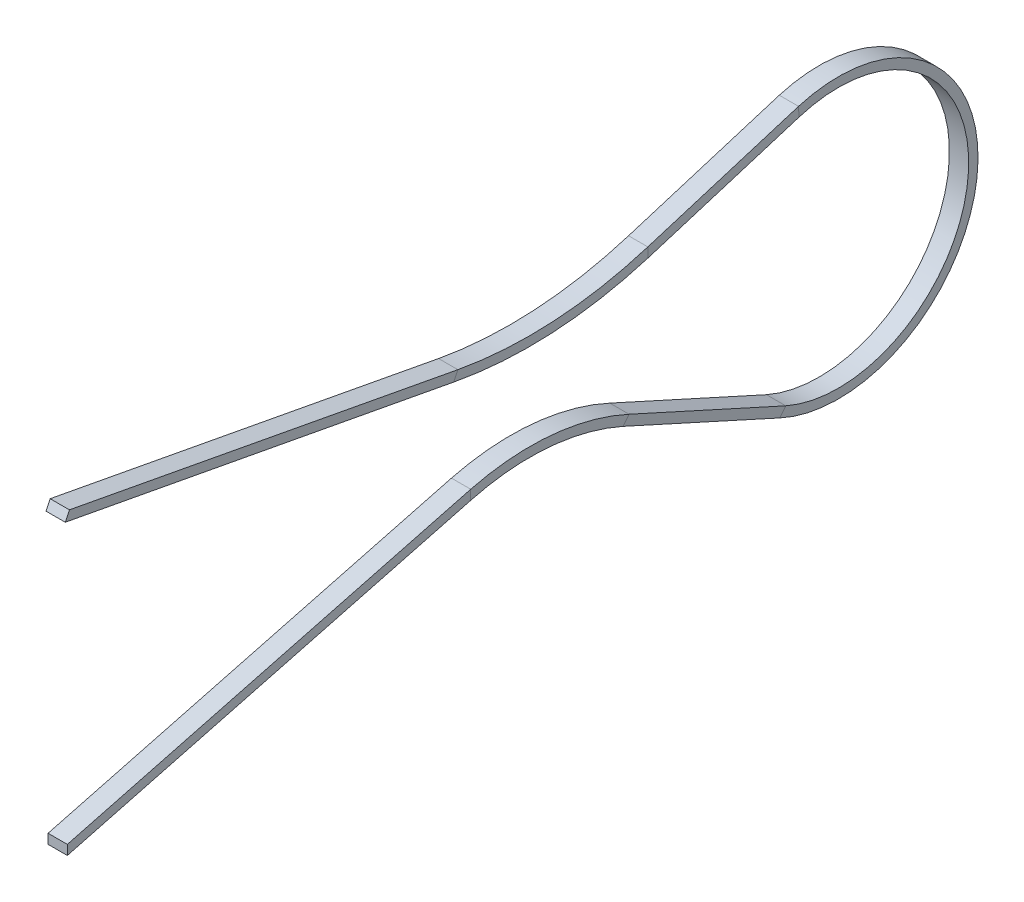
ISO-10303-21;
HEADER;
FILE_DESCRIPTION(('STEP AP214'),'2;1');
FILE_NAME('part.step','',(''),(''),'','','');
FILE_SCHEMA(('AUTOMOTIVE_DESIGN { 1 0 10303 214 1 1 1 1 }'));
ENDSEC;
DATA;
#1=APPLICATION_CONTEXT('core data for automotive mechanical design processes');
#2=APPLICATION_PROTOCOL_DEFINITION('international standard','automotive_design',2000,#1);
#3=PRODUCT_CONTEXT('',#1,'mechanical');
#4=PRODUCT('Part','Part','',(#3));
#5=PRODUCT_RELATED_PRODUCT_CATEGORY('part','',(#4));
#6=PRODUCT_DEFINITION_FORMATION('','',#4);
#7=PRODUCT_DEFINITION_CONTEXT('part definition',#1,'design');
#8=PRODUCT_DEFINITION('design','',#6,#7);
#9=PRODUCT_DEFINITION_SHAPE('','',#8);
#10=(LENGTH_UNIT() NAMED_UNIT(*) SI_UNIT(.MILLI.,.METRE.));
#11=(NAMED_UNIT(*) PLANE_ANGLE_UNIT() SI_UNIT($,.RADIAN.));
#12=(NAMED_UNIT(*) SI_UNIT($,.STERADIAN.) SOLID_ANGLE_UNIT());
#13=UNCERTAINTY_MEASURE_WITH_UNIT(LENGTH_MEASURE(1.E-05),#10,'distance_accuracy_value','');
#14=(GEOMETRIC_REPRESENTATION_CONTEXT(3) GLOBAL_UNCERTAINTY_ASSIGNED_CONTEXT((#13)) GLOBAL_UNIT_ASSIGNED_CONTEXT((#10,
#11,#12)) REPRESENTATION_CONTEXT('',''));
#15=CARTESIAN_POINT('',(0.,0.,0.));
#16=DIRECTION('',(0.,0.,1.));
#17=DIRECTION('',(1.,0.,0.));
#18=AXIS2_PLACEMENT_3D('',#15,#16,#17);
#19=CARTESIAN_POINT('',(0.,0.,0.));
#20=DIRECTION('',(0.,0.,1.));
#21=DIRECTION('',(1.,0.,0.));
#22=AXIS2_PLACEMENT_3D('',#19,#20,#21);
#23=PLANE('',#22);
#24=DIRECTION('',(0.,1.,0.));
#25=VECTOR('',#24,1.);
#26=CARTESIAN_POINT('',(0.5,0.25,0.));
#27=LINE('',#26,#25);
#28=CARTESIAN_POINT('',(0.5,-0.25,0.));
#29=VERTEX_POINT('',#28);
#30=CARTESIAN_POINT('',(0.5,0.25,0.));
#31=VERTEX_POINT('',#30);
#32=EDGE_CURVE('E181',#29,#31,#27,.T.);
#33=ORIENTED_EDGE('',*,*,#32,.T.);
#34=DIRECTION('',(-1.,0.,0.));
#35=VECTOR('',#34,1.);
#36=CARTESIAN_POINT('',(-0.5,0.25,0.));
#37=LINE('',#36,#35);
#38=CARTESIAN_POINT('',(-0.5,0.25,0.));
#39=VERTEX_POINT('',#38);
#40=EDGE_CURVE('E180',#31,#39,#37,.T.);
#41=ORIENTED_EDGE('',*,*,#40,.T.);
#42=DIRECTION('',(0.,-1.,0.));
#43=VECTOR('',#42,1.);
#44=CARTESIAN_POINT('',(-0.5,0.25,0.));
#45=LINE('',#44,#43);
#46=CARTESIAN_POINT('',(-0.5,-0.25,0.));
#47=VERTEX_POINT('',#46);
#48=EDGE_CURVE('E167',#39,#47,#45,.T.);
#49=ORIENTED_EDGE('',*,*,#48,.T.);
#50=DIRECTION('',(1.,0.,0.));
#51=VECTOR('',#50,1.);
#52=CARTESIAN_POINT('',(-0.5,-0.25,0.));
#53=LINE('',#52,#51);
#54=EDGE_CURVE('E177',#47,#29,#53,.T.);
#55=ORIENTED_EDGE('',*,*,#54,.T.);
#56=EDGE_LOOP('',(#33,#41,#49,#55));
#57=FACE_BOUND('',#56,.T.);
#58=ADVANCED_FACE('F35',(#57),#23,.T.);
#59=CARTESIAN_POINT('',(0.,15.,0.));
#60=DIRECTION('',(0.,-0.427760387668771,-0.903892167651353));
#61=DIRECTION('',(1.,0.,0.));
#62=AXIS2_PLACEMENT_3D('',#59,#60,#61);
#63=PLANE('',#62);
#64=DIRECTION('',(0.,-0.903892167651353,0.427760387668771));
#65=VECTOR('',#64,1.);
#66=CARTESIAN_POINT('',(0.5,14.7740269580872,0.106940096917189));
#67=LINE('',#66,#65);
#68=CARTESIAN_POINT('',(0.5,15.2259730419128,-0.106940096917198));
#69=VERTEX_POINT('',#68);
#70=CARTESIAN_POINT('',(0.5,14.7740269580872,0.106940096917187));
#71=VERTEX_POINT('',#70);
#72=EDGE_CURVE('E49',#69,#71,#67,.T.);
#73=ORIENTED_EDGE('',*,*,#72,.F.);
#74=DIRECTION('',(1.,0.,0.));
#75=VECTOR('',#74,1.);
#76=CARTESIAN_POINT('',(-0.5,15.2259730419128,-0.106940096917196));
#77=LINE('',#76,#75);
#78=CARTESIAN_POINT('',(-0.5,15.2259730419128,-0.106940096917198));
#79=VERTEX_POINT('',#78);
#80=EDGE_CURVE('E58',#79,#69,#77,.T.);
#81=ORIENTED_EDGE('',*,*,#80,.F.);
#82=DIRECTION('',(0.,0.903892167651353,-0.427760387668771));
#83=VECTOR('',#82,1.);
#84=CARTESIAN_POINT('',(-0.5,14.7740269580872,0.106940096917189));
#85=LINE('',#84,#83);
#86=CARTESIAN_POINT('',(-0.5,14.7740269580872,0.106940096917187));
#87=VERTEX_POINT('',#86);
#88=EDGE_CURVE('E247',#87,#79,#85,.T.);
#89=ORIENTED_EDGE('',*,*,#88,.F.);
#90=DIRECTION('',(-1.,0.,0.));
#91=VECTOR('',#90,1.);
#92=CARTESIAN_POINT('',(-0.5,14.7740269580872,0.106940096917189));
#93=LINE('',#92,#91);
#94=EDGE_CURVE('E11',#71,#87,#93,.T.);
#95=ORIENTED_EDGE('',*,*,#94,.F.);
#96=EDGE_LOOP('',(#73,#81,#89,#95));
#97=FACE_BOUND('',#96,.T.);
#98=ADVANCED_FACE('F390',(#97),#63,.F.);
#99=CARTESIAN_POINT('',(-0.5,0.25,0.));
#100=DIRECTION('',(1.,0.,0.));
#101=DIRECTION('',(0.,1.,0.));
#102=AXIS2_PLACEMENT_3D('',#99,#100,#101);
#103=PLANE('',#102);
#104=DIRECTION('',(0.,0.253856824292073,-0.967241806768268));
#105=VECTOR('',#104,1.);
#106=CARTESIAN_POINT('',(-0.5,-0.25,0.));
#107=LINE('',#106,#105);
#108=CARTESIAN_POINT('',(-0.5,5.24194972708737,-20.9253518849537));
#109=VERTEX_POINT('',#108);
#110=EDGE_CURVE('E174',#47,#109,#107,.T.);
#111=ORIENTED_EDGE('',*,*,#110,.F.);
#112=ORIENTED_EDGE('',*,*,#48,.F.);
#113=DIRECTION('',(0.,0.253856824292073,-0.967241806768268));
#114=VECTOR('',#113,1.);
#115=CARTESIAN_POINT('',(-0.5,0.25,0.));
#116=LINE('',#115,#114);
#117=CARTESIAN_POINT('',(-0.5,5.74194972708737,-20.9253518849537));
#118=VERTEX_POINT('',#117);
#119=EDGE_CURVE('E172',#39,#118,#116,.T.);
#120=ORIENTED_EDGE('',*,*,#119,.T.);
#121=DIRECTION('',(0.,-1.,0.));
#122=VECTOR('',#121,1.);
#123=CARTESIAN_POINT('',(-0.5,5.74194972708737,-20.9253518849537));
#124=LINE('',#123,#122);
#125=EDGE_CURVE('E191',#118,#109,#124,.T.);
#126=ORIENTED_EDGE('',*,*,#125,.T.);
#127=EDGE_LOOP('',(#111,#112,#120,#126));
#128=FACE_BOUND('',#127,.T.);
#129=ADVANCED_FACE('F169',(#128),#103,.F.);
#130=CARTESIAN_POINT('',(-0.5,-0.25,0.));
#131=DIRECTION('',(0.,0.967241806768268,0.253856824292073));
#132=DIRECTION('',(0.,-0.253856824292073,0.967241806768268));
#133=AXIS2_PLACEMENT_3D('',#130,#131,#132);
#134=PLANE('',#133);
#135=DIRECTION('',(0.,0.253856824292073,-0.967241806768268));
#136=VECTOR('',#135,1.);
#137=CARTESIAN_POINT('',(0.5,-0.25,0.));
#138=LINE('',#137,#136);
#139=CARTESIAN_POINT('',(0.5,5.24194972708737,-20.9253518849537));
#140=VERTEX_POINT('',#139);
#141=EDGE_CURVE('E258',#29,#140,#138,.T.);
#142=ORIENTED_EDGE('',*,*,#141,.F.);
#143=ORIENTED_EDGE('',*,*,#54,.F.);
#144=ORIENTED_EDGE('',*,*,#110,.T.);
#145=DIRECTION('',(1.,0.,0.));
#146=VECTOR('',#145,1.);
#147=CARTESIAN_POINT('',(-0.5,5.24194972708737,-20.9253518849537));
#148=LINE('',#147,#146);
#149=EDGE_CURVE('E255',#109,#140,#148,.T.);
#150=ORIENTED_EDGE('',*,*,#149,.T.);
#151=EDGE_LOOP('',(#142,#143,#144,#150));
#152=FACE_BOUND('',#151,.T.);
#153=ADVANCED_FACE('F397',(#152),#134,.F.);
#154=CARTESIAN_POINT('',(0.5,0.25,0.));
#155=DIRECTION('',(-1.,0.,0.));
#156=DIRECTION('',(0.,-1.,0.));
#157=AXIS2_PLACEMENT_3D('',#154,#155,#156);
#158=PLANE('',#157);
#159=DIRECTION('',(0.,0.253856824292073,-0.967241806768268));
#160=VECTOR('',#159,1.);
#161=CARTESIAN_POINT('',(0.5,0.25,0.));
#162=LINE('',#161,#160);
#163=CARTESIAN_POINT('',(0.5,5.74194972708737,-20.9253518849537));
#164=VERTEX_POINT('',#163);
#165=EDGE_CURVE('E294',#31,#164,#162,.T.);
#166=ORIENTED_EDGE('',*,*,#165,.F.);
#167=ORIENTED_EDGE('',*,*,#32,.F.);
#168=ORIENTED_EDGE('',*,*,#141,.T.);
#169=DIRECTION('',(0.,1.,0.));
#170=VECTOR('',#169,1.);
#171=CARTESIAN_POINT('',(0.5,5.74194972708737,-20.9253518849537));
#172=LINE('',#171,#170);
#173=EDGE_CURVE('E261',#140,#164,#172,.T.);
#174=ORIENTED_EDGE('',*,*,#173,.T.);
#175=EDGE_LOOP('',(#166,#167,#168,#174));
#176=FACE_BOUND('',#175,.T.);
#177=ADVANCED_FACE('F372',(#176),#158,.F.);
#178=CARTESIAN_POINT('',(-0.5,0.25,0.));
#179=DIRECTION('',(0.,-0.967241806768268,-0.253856824292073));
#180=DIRECTION('',(0.,0.253856824292073,-0.967241806768268));
#181=AXIS2_PLACEMENT_3D('',#178,#179,#180);
#182=PLANE('',#181);
#183=DIRECTION('',(-1.,0.,0.));
#184=VECTOR('',#183,1.);
#185=CARTESIAN_POINT('',(-0.5,5.74194972708737,-20.9253518849537));
#186=LINE('',#185,#184);
#187=EDGE_CURVE('E189',#164,#118,#186,.T.);
#188=ORIENTED_EDGE('',*,*,#187,.T.);
#189=ORIENTED_EDGE('',*,*,#119,.F.);
#190=ORIENTED_EDGE('',*,*,#40,.F.);
#191=ORIENTED_EDGE('',*,*,#165,.T.);
#192=EDGE_LOOP('',(#188,#189,#190,#191));
#193=FACE_BOUND('',#192,.T.);
#194=ADVANCED_FACE('F187',(#193),#182,.F.);
#195=CARTESIAN_POINT('',(-0.5,5.74194972708737,-20.9253518849537));
#196=DIRECTION('',(1.,0.,0.));
#197=DIRECTION('',(0.,0.,-1.));
#198=AXIS2_PLACEMENT_3D('',#195,#196,#197);
#199=PLANE('',#198);
#200=CARTESIAN_POINT('',(-0.5,-6.19830900660814,-23.9935111978809));
#201=DIRECTION('',(-1.,0.,0.));
#202=DIRECTION('',(0.,0.965867732518851,0.25903575675743));
#203=AXIS2_PLACEMENT_3D('',#200,#201,#202);
#204=CIRCLE('',#203,11.8445397320199);
#205=CARTESIAN_POINT('',(-0.5,4.61492297526486,-28.8274677108832));
#206=VERTEX_POINT('',#205);
#207=EDGE_CURVE('E199',#109,#206,#204,.T.);
#208=ORIENTED_EDGE('',*,*,#207,.F.);
#209=ORIENTED_EDGE('',*,*,#125,.F.);
#210=CARTESIAN_POINT('',(-0.5,-6.19830900660814,-23.9935111978809));
#211=DIRECTION('',(-1.,0.,0.));
#212=DIRECTION('',(0.,0.968535821916987,0.248874188423763));
#213=AXIS2_PLACEMENT_3D('',#210,#211,#212);
#214=CIRCLE('',#213,12.3281539655008);
#215=CARTESIAN_POINT('',(-0.5,5.00294920844996,-29.1428018865765));
#216=VERTEX_POINT('',#215);
#217=EDGE_CURVE('E200',#118,#216,#214,.T.);
#218=ORIENTED_EDGE('',*,*,#217,.T.);
#219=DIRECTION('',(0.,-0.776052466370204,0.630668351386625));
#220=VECTOR('',#219,1.);
#221=CARTESIAN_POINT('',(-0.5,5.00294920844996,-29.1428018865765));
#222=LINE('',#221,#220);
#223=EDGE_CURVE('E196',#216,#206,#222,.T.);
#224=ORIENTED_EDGE('',*,*,#223,.T.);
#225=EDGE_LOOP('',(#208,#209,#218,#224));
#226=FACE_BOUND('',#225,.T.);
#227=ADVANCED_FACE('F371',(#226),#199,.F.);
#228=CARTESIAN_POINT('',(0.,-6.19830900660814,-23.9935111978809));
#229=DIRECTION('',(-1.,0.,0.));
#230=DIRECTION('',(0.,0.,1.));
#231=AXIS2_PLACEMENT_3D('',#228,#229,#230);
#232=CYLINDRICAL_SURFACE('',#231,11.8445397320199);
#233=CARTESIAN_POINT('',(0.5,-6.19830900660814,-23.9935111978809));
#234=DIRECTION('',(-1.,0.,0.));
#235=DIRECTION('',(0.,0.965867732518851,0.25903575675743));
#236=AXIS2_PLACEMENT_3D('',#233,#234,#235);
#237=CIRCLE('',#236,11.8445397320199);
#238=CARTESIAN_POINT('',(0.5,4.61492297526486,-28.8274677108832));
#239=VERTEX_POINT('',#238);
#240=EDGE_CURVE('E264',#140,#239,#237,.T.);
#241=ORIENTED_EDGE('',*,*,#240,.F.);
#242=ORIENTED_EDGE('',*,*,#149,.F.);
#243=ORIENTED_EDGE('',*,*,#207,.T.);
#244=DIRECTION('',(1.,0.,0.));
#245=VECTOR('',#244,1.);
#246=CARTESIAN_POINT('',(-0.5,4.61492297526486,-28.8274677108832));
#247=LINE('',#246,#245);
#248=EDGE_CURVE('E203',#206,#239,#247,.T.);
#249=ORIENTED_EDGE('',*,*,#248,.T.);
#250=EDGE_LOOP('',(#241,#242,#243,#249));
#251=FACE_BOUND('',#250,.T.);
#252=ADVANCED_FACE('F421',(#251),#232,.F.);
#253=CARTESIAN_POINT('',(0.5,5.74194972708737,-20.9253518849537));
#254=DIRECTION('',(-1.,0.,0.));
#255=DIRECTION('',(0.,0.,1.));
#256=AXIS2_PLACEMENT_3D('',#253,#254,#255);
#257=PLANE('',#256);
#258=CARTESIAN_POINT('',(0.5,-6.19830900660814,-23.9935111978809));
#259=DIRECTION('',(-1.,0.,0.));
#260=DIRECTION('',(0.,0.968535821916987,0.248874188423763));
#261=AXIS2_PLACEMENT_3D('',#258,#259,#260);
#262=CIRCLE('',#261,12.3281539655008);
#263=CARTESIAN_POINT('',(0.5,5.00294920844996,-29.1428018865765));
#264=VERTEX_POINT('',#263);
#265=EDGE_CURVE('E298',#164,#264,#262,.T.);
#266=ORIENTED_EDGE('',*,*,#265,.F.);
#267=ORIENTED_EDGE('',*,*,#173,.F.);
#268=ORIENTED_EDGE('',*,*,#240,.T.);
#269=DIRECTION('',(0.,0.776052466370204,-0.630668351386625));
#270=VECTOR('',#269,1.);
#271=CARTESIAN_POINT('',(0.5,5.00294920844996,-29.1428018865765));
#272=LINE('',#271,#270);
#273=EDGE_CURVE('E267',#239,#264,#272,.T.);
#274=ORIENTED_EDGE('',*,*,#273,.T.);
#275=EDGE_LOOP('',(#266,#267,#268,#274));
#276=FACE_BOUND('',#275,.T.);
#277=ADVANCED_FACE('F377',(#276),#257,.F.);
#278=CARTESIAN_POINT('',(0.,-6.19830900660814,-23.9935111978809));
#279=DIRECTION('',(-1.,0.,0.));
#280=DIRECTION('',(0.,0.,1.));
#281=AXIS2_PLACEMENT_3D('',#278,#279,#280);
#282=CYLINDRICAL_SURFACE('',#281,12.3281539655008);
#283=DIRECTION('',(-1.,0.,0.));
#284=VECTOR('',#283,1.);
#285=CARTESIAN_POINT('',(-0.5,5.00294920844996,-29.1428018865765));
#286=LINE('',#285,#284);
#287=EDGE_CURVE('E216',#264,#216,#286,.T.);
#288=ORIENTED_EDGE('',*,*,#287,.T.);
#289=ORIENTED_EDGE('',*,*,#217,.F.);
#290=ORIENTED_EDGE('',*,*,#187,.F.);
#291=ORIENTED_EDGE('',*,*,#265,.T.);
#292=EDGE_LOOP('',(#288,#289,#290,#291));
#293=FACE_BOUND('',#292,.T.);
#294=ADVANCED_FACE('F373',(#293),#282,.T.);
#295=CARTESIAN_POINT('',(-0.5,5.00294920844996,-29.1428018865765));
#296=DIRECTION('',(1.,0.,0.));
#297=DIRECTION('',(0.,1.,0.));
#298=AXIS2_PLACEMENT_3D('',#295,#296,#297);
#299=PLANE('',#298);
#300=DIRECTION('',(0.,-0.413002581069993,-0.910729854583412));
#301=VECTOR('',#300,1.);
#302=CARTESIAN_POINT('',(-0.5,4.61492297526485,-28.8274677108832));
#303=LINE('',#302,#301);
#304=CARTESIAN_POINT('',(-0.5,0.930877901323559,-36.9513148446634));
#305=VERTEX_POINT('',#304);
#306=EDGE_CURVE('E209',#206,#305,#303,.T.);
#307=ORIENTED_EDGE('',*,*,#306,.F.);
#308=ORIENTED_EDGE('',*,*,#223,.F.);
#309=DIRECTION('',(0.,-0.413002581069993,-0.910729854583412));
#310=VECTOR('',#309,1.);
#311=CARTESIAN_POINT('',(-0.5,5.00294920844996,-29.1428018865765));
#312=LINE('',#311,#310);
#313=CARTESIAN_POINT('',(-0.5,1.31890413450866,-37.2666490203567));
#314=VERTEX_POINT('',#313);
#315=EDGE_CURVE('E210',#216,#314,#312,.T.);
#316=ORIENTED_EDGE('',*,*,#315,.T.);
#317=DIRECTION('',(0.,-0.776052466370204,0.630668351386625));
#318=VECTOR('',#317,1.);
#319=CARTESIAN_POINT('',(-0.5,1.31890413450866,-37.2666490203567));
#320=LINE('',#319,#318);
#321=EDGE_CURVE('E206',#314,#305,#320,.T.);
#322=ORIENTED_EDGE('',*,*,#321,.T.);
#323=EDGE_LOOP('',(#307,#308,#316,#322));
#324=FACE_BOUND('',#323,.T.);
#325=ADVANCED_FACE('F376',(#324),#299,.F.);
#326=CARTESIAN_POINT('',(-0.5,4.61492297526485,-28.8274677108832));
#327=DIRECTION('',(0.,0.910729854583413,-0.413002581069993));
#328=DIRECTION('',(0.,0.413002581069993,0.910729854583412));
#329=AXIS2_PLACEMENT_3D('',#326,#327,#328);
#330=PLANE('',#329);
#331=DIRECTION('',(0.,-0.413002581069993,-0.910729854583412));
#332=VECTOR('',#331,1.);
#333=CARTESIAN_POINT('',(0.5,4.61492297526485,-28.8274677108832));
#334=LINE('',#333,#332);
#335=CARTESIAN_POINT('',(0.5,0.930877901323559,-36.9513148446634));
#336=VERTEX_POINT('',#335);
#337=EDGE_CURVE('E270',#239,#336,#334,.T.);
#338=ORIENTED_EDGE('',*,*,#337,.F.);
#339=ORIENTED_EDGE('',*,*,#248,.F.);
#340=ORIENTED_EDGE('',*,*,#306,.T.);
#341=DIRECTION('',(1.,0.,0.));
#342=VECTOR('',#341,1.);
#343=CARTESIAN_POINT('',(-0.5,0.930877901323561,-36.9513148446634));
#344=LINE('',#343,#342);
#345=EDGE_CURVE('E213',#305,#336,#344,.T.);
#346=ORIENTED_EDGE('',*,*,#345,.T.);
#347=EDGE_LOOP('',(#338,#339,#340,#346));
#348=FACE_BOUND('',#347,.T.);
#349=ADVANCED_FACE('F418',(#348),#330,.F.);
#350=CARTESIAN_POINT('',(0.5,5.00294920844996,-29.1428018865765));
#351=DIRECTION('',(-1.,0.,0.));
#352=DIRECTION('',(0.,-1.,0.));
#353=AXIS2_PLACEMENT_3D('',#350,#351,#352);
#354=PLANE('',#353);
#355=DIRECTION('',(0.,-0.413002581069993,-0.910729854583412));
#356=VECTOR('',#355,1.);
#357=CARTESIAN_POINT('',(0.5,5.00294920844996,-29.1428018865765));
#358=LINE('',#357,#356);
#359=CARTESIAN_POINT('',(0.5,1.31890413450866,-37.2666490203567));
#360=VERTEX_POINT('',#359);
#361=EDGE_CURVE('E303',#264,#360,#358,.T.);
#362=ORIENTED_EDGE('',*,*,#361,.F.);
#363=ORIENTED_EDGE('',*,*,#273,.F.);
#364=ORIENTED_EDGE('',*,*,#337,.T.);
#365=DIRECTION('',(0.,0.776052466370204,-0.630668351386625));
#366=VECTOR('',#365,1.);
#367=CARTESIAN_POINT('',(0.5,1.31890413450866,-37.2666490203567));
#368=LINE('',#367,#366);
#369=EDGE_CURVE('E273',#336,#360,#368,.T.);
#370=ORIENTED_EDGE('',*,*,#369,.T.);
#371=EDGE_LOOP('',(#362,#363,#364,#370));
#372=FACE_BOUND('',#371,.T.);
#373=ADVANCED_FACE('F383',(#372),#354,.F.);
#374=CARTESIAN_POINT('',(-0.5,5.00294920844996,-29.1428018865765));
#375=DIRECTION('',(0.,-0.910729854583413,0.413002581069993));
#376=DIRECTION('',(0.,-0.413002581069993,-0.910729854583412));
#377=AXIS2_PLACEMENT_3D('',#374,#375,#376);
#378=PLANE('',#377);
#379=DIRECTION('',(-1.,0.,0.));
#380=VECTOR('',#379,1.);
#381=CARTESIAN_POINT('',(-0.5,1.31890413450866,-37.2666490203567));
#382=LINE('',#381,#380);
#383=EDGE_CURVE('E227',#360,#314,#382,.T.);
#384=ORIENTED_EDGE('',*,*,#383,.T.);
#385=ORIENTED_EDGE('',*,*,#315,.F.);
#386=ORIENTED_EDGE('',*,*,#287,.F.);
#387=ORIENTED_EDGE('',*,*,#361,.T.);
#388=EDGE_LOOP('',(#384,#385,#386,#387));
#389=FACE_BOUND('',#388,.T.);
#390=ADVANCED_FACE('F379',(#389),#378,.F.);
#391=CARTESIAN_POINT('',(-0.5,1.31890413450866,-37.2666490203567));
#392=DIRECTION('',(1.,0.,0.));
#393=DIRECTION('',(0.,0.,-1.));
#394=AXIS2_PLACEMENT_3D('',#391,#392,#393);
#395=PLANE('',#394);
#396=CARTESIAN_POINT('',(-0.5,7.5,-40.));
#397=DIRECTION('',(1.,0.,0.));
#398=DIRECTION('',(0.,-0.90707564102538,0.420967672699932));
#399=AXIS2_PLACEMENT_3D('',#396,#397,#398);
#400=CIRCLE('',#399,7.2420885332678);
#401=CARTESIAN_POINT('',(-0.5,14.4404804570597,-37.931769512636));
#402=VERTEX_POINT('',#401);
#403=EDGE_CURVE('E220',#305,#402,#400,.T.);
#404=ORIENTED_EDGE('',*,*,#403,.F.);
#405=ORIENTED_EDGE('',*,*,#321,.F.);
#406=CARTESIAN_POINT('',(-0.5,7.5,-40.));
#407=DIRECTION('',(1.,0.,0.));
#408=DIRECTION('',(0.,-0.914567917628712,0.404432347920244));
#409=AXIS2_PLACEMENT_3D('',#406,#407,#408);
#410=CIRCLE('',#409,6.75848752875309);
#411=CARTESIAN_POINT('',(-0.5,13.9409154152968,-37.9526206288762));
#412=VERTEX_POINT('',#411);
#413=EDGE_CURVE('E221',#314,#412,#410,.T.);
#414=ORIENTED_EDGE('',*,*,#413,.T.);
#415=DIRECTION('',(0.,0.999130083525739,0.041702232480395));
#416=VECTOR('',#415,1.);
#417=CARTESIAN_POINT('',(-0.5,13.9409154152968,-37.9526206288762));
#418=LINE('',#417,#416);
#419=EDGE_CURVE('E217',#412,#402,#418,.T.);
#420=ORIENTED_EDGE('',*,*,#419,.T.);
#421=EDGE_LOOP('',(#404,#405,#414,#420));
#422=FACE_BOUND('',#421,.T.);
#423=ADVANCED_FACE('F382',(#422),#395,.F.);
#424=CARTESIAN_POINT('',(0.,7.5,-40.));
#425=DIRECTION('',(1.,0.,0.));
#426=DIRECTION('',(0.,0.,-1.));
#427=AXIS2_PLACEMENT_3D('',#424,#425,#426);
#428=CYLINDRICAL_SURFACE('',#427,7.2420885332678);
#429=CARTESIAN_POINT('',(0.5,7.5,-40.));
#430=DIRECTION('',(1.,0.,0.));
#431=DIRECTION('',(0.,-0.90707564102538,0.420967672699932));
#432=AXIS2_PLACEMENT_3D('',#429,#430,#431);
#433=CIRCLE('',#432,7.2420885332678);
#434=CARTESIAN_POINT('',(0.5,14.4404804570597,-37.931769512636));
#435=VERTEX_POINT('',#434);
#436=EDGE_CURVE('E276',#336,#435,#433,.T.);
#437=ORIENTED_EDGE('',*,*,#436,.F.);
#438=ORIENTED_EDGE('',*,*,#345,.F.);
#439=ORIENTED_EDGE('',*,*,#403,.T.);
#440=DIRECTION('',(1.,0.,0.));
#441=VECTOR('',#440,1.);
#442=CARTESIAN_POINT('',(-0.5,14.4404804570597,-37.931769512636));
#443=LINE('',#442,#441);
#444=EDGE_CURVE('E224',#402,#435,#443,.T.);
#445=ORIENTED_EDGE('',*,*,#444,.T.);
#446=EDGE_LOOP('',(#437,#438,#439,#445));
#447=FACE_BOUND('',#446,.T.);
#448=ADVANCED_FACE('F406',(#447),#428,.T.);
#449=CARTESIAN_POINT('',(0.5,1.31890413450866,-37.2666490203567));
#450=DIRECTION('',(-1.,0.,0.));
#451=DIRECTION('',(0.,0.,1.));
#452=AXIS2_PLACEMENT_3D('',#449,#450,#451);
#453=PLANE('',#452);
#454=CARTESIAN_POINT('',(0.5,7.5,-40.));
#455=DIRECTION('',(1.,0.,0.));
#456=DIRECTION('',(0.,-0.914567917628712,0.404432347920244));
#457=AXIS2_PLACEMENT_3D('',#454,#455,#456);
#458=CIRCLE('',#457,6.75848752875309);
#459=CARTESIAN_POINT('',(0.5,13.9409154152968,-37.9526206288762));
#460=VERTEX_POINT('',#459);
#461=EDGE_CURVE('E308',#360,#460,#458,.T.);
#462=ORIENTED_EDGE('',*,*,#461,.F.);
#463=ORIENTED_EDGE('',*,*,#369,.F.);
#464=ORIENTED_EDGE('',*,*,#436,.T.);
#465=DIRECTION('',(0.,-0.999130083525739,-0.041702232480395));
#466=VECTOR('',#465,1.);
#467=CARTESIAN_POINT('',(0.5,13.9409154152968,-37.9526206288762));
#468=LINE('',#467,#466);
#469=EDGE_CURVE('E279',#435,#460,#468,.T.);
#470=ORIENTED_EDGE('',*,*,#469,.T.);
#471=EDGE_LOOP('',(#462,#463,#464,#470));
#472=FACE_BOUND('',#471,.T.);
#473=ADVANCED_FACE('F350',(#472),#453,.F.);
#474=CARTESIAN_POINT('',(0.,7.5,-40.));
#475=DIRECTION('',(1.,0.,0.));
#476=DIRECTION('',(0.,0.,-1.));
#477=AXIS2_PLACEMENT_3D('',#474,#475,#476);
#478=CYLINDRICAL_SURFACE('',#477,6.75848752875309);
#479=DIRECTION('',(-1.,0.,0.));
#480=VECTOR('',#479,1.);
#481=CARTESIAN_POINT('',(-0.5,13.9409154152968,-37.9526206288762));
#482=LINE('',#481,#480);
#483=EDGE_CURVE('E238',#460,#412,#482,.T.);
#484=ORIENTED_EDGE('',*,*,#483,.T.);
#485=ORIENTED_EDGE('',*,*,#413,.F.);
#486=ORIENTED_EDGE('',*,*,#383,.F.);
#487=ORIENTED_EDGE('',*,*,#461,.T.);
#488=EDGE_LOOP('',(#484,#485,#486,#487));
#489=FACE_BOUND('',#488,.T.);
#490=ADVANCED_FACE('F345',(#489),#478,.F.);
#491=CARTESIAN_POINT('',(-0.5,13.9409154152968,-37.9526206288762));
#492=DIRECTION('',(1.,0.,0.));
#493=DIRECTION('',(0.,1.,0.));
#494=AXIS2_PLACEMENT_3D('',#491,#492,#493);
#495=PLANE('',#494);
#496=DIRECTION('',(0.,-0.293972132749126,0.955813990882604));
#497=VECTOR('',#496,1.);
#498=CARTESIAN_POINT('',(-0.5,14.4404804570597,-37.931769512636));
#499=LINE('',#498,#497);
#500=CARTESIAN_POINT('',(-0.5,12.0357763623501,-30.1131718919643));
#501=VERTEX_POINT('',#500);
#502=EDGE_CURVE('E231',#402,#501,#499,.T.);
#503=ORIENTED_EDGE('',*,*,#502,.F.);
#504=ORIENTED_EDGE('',*,*,#419,.F.);
#505=DIRECTION('',(0.,-0.293972132749126,0.955813990882604));
#506=VECTOR('',#505,1.);
#507=CARTESIAN_POINT('',(-0.5,13.9409154152968,-37.9526206288762));
#508=LINE('',#507,#506);
#509=CARTESIAN_POINT('',(-0.5,11.5362113205872,-30.1340230082045));
#510=VERTEX_POINT('',#509);
#511=EDGE_CURVE('E232',#412,#510,#508,.T.);
#512=ORIENTED_EDGE('',*,*,#511,.T.);
#513=DIRECTION('',(0.,0.999130083525739,0.0417022324803958));
#514=VECTOR('',#513,1.);
#515=CARTESIAN_POINT('',(-0.5,11.5362113205872,-30.1340230082045));
#516=LINE('',#515,#514);
#517=EDGE_CURVE('E228',#510,#501,#516,.T.);
#518=ORIENTED_EDGE('',*,*,#517,.T.);
#519=EDGE_LOOP('',(#503,#504,#512,#518));
#520=FACE_BOUND('',#519,.T.);
#521=ADVANCED_FACE('F340',(#520),#495,.F.);
#522=CARTESIAN_POINT('',(-0.5,14.4404804570597,-37.931769512636));
#523=DIRECTION('',(0.,-0.955813990882604,-0.293972132749126));
#524=DIRECTION('',(0.,0.293972132749126,-0.955813990882604));
#525=AXIS2_PLACEMENT_3D('',#522,#523,#524);
#526=PLANE('',#525);
#527=DIRECTION('',(0.,-0.293972132749126,0.955813990882604));
#528=VECTOR('',#527,1.);
#529=CARTESIAN_POINT('',(0.5,14.4404804570597,-37.931769512636));
#530=LINE('',#529,#528);
#531=CARTESIAN_POINT('',(0.5,12.0357763623501,-30.1131718919643));
#532=VERTEX_POINT('',#531);
#533=EDGE_CURVE('E282',#435,#532,#530,.T.);
#534=ORIENTED_EDGE('',*,*,#533,.F.);
#535=ORIENTED_EDGE('',*,*,#444,.F.);
#536=ORIENTED_EDGE('',*,*,#502,.T.);
#537=DIRECTION('',(1.,0.,0.));
#538=VECTOR('',#537,1.);
#539=CARTESIAN_POINT('',(-0.5,12.0357763623501,-30.1131718919643));
#540=LINE('',#539,#538);
#541=EDGE_CURVE('E235',#501,#532,#540,.T.);
#542=ORIENTED_EDGE('',*,*,#541,.T.);
#543=EDGE_LOOP('',(#534,#535,#536,#542));
#544=FACE_BOUND('',#543,.T.);
#545=ADVANCED_FACE('F403',(#544),#526,.F.);
#546=CARTESIAN_POINT('',(0.5,13.9409154152968,-37.9526206288762));
#547=DIRECTION('',(-1.,0.,0.));
#548=DIRECTION('',(0.,-1.,0.));
#549=AXIS2_PLACEMENT_3D('',#546,#547,#548);
#550=PLANE('',#549);
#551=DIRECTION('',(0.,-0.293972132749126,0.955813990882604));
#552=VECTOR('',#551,1.);
#553=CARTESIAN_POINT('',(0.5,13.9409154152968,-37.9526206288762));
#554=LINE('',#553,#552);
#555=CARTESIAN_POINT('',(0.5,11.5362113205872,-30.1340230082045));
#556=VERTEX_POINT('',#555);
#557=EDGE_CURVE('E313',#460,#556,#554,.T.);
#558=ORIENTED_EDGE('',*,*,#557,.F.);
#559=ORIENTED_EDGE('',*,*,#469,.F.);
#560=ORIENTED_EDGE('',*,*,#533,.T.);
#561=DIRECTION('',(0.,-0.999130083525739,-0.0417022324803958));
#562=VECTOR('',#561,1.);
#563=CARTESIAN_POINT('',(0.5,11.5362113205872,-30.1340230082045));
#564=LINE('',#563,#562);
#565=EDGE_CURVE('E285',#532,#556,#564,.T.);
#566=ORIENTED_EDGE('',*,*,#565,.T.);
#567=EDGE_LOOP('',(#558,#559,#560,#566));
#568=FACE_BOUND('',#567,.T.);
#569=ADVANCED_FACE('F352',(#568),#550,.F.);
#570=CARTESIAN_POINT('',(-0.5,13.9409154152968,-37.9526206288762));
#571=DIRECTION('',(0.,0.955813990882604,0.293972132749126));
#572=DIRECTION('',(0.,-0.293972132749126,0.955813990882604));
#573=AXIS2_PLACEMENT_3D('',#570,#571,#572);
#574=PLANE('',#573);
#575=DIRECTION('',(-1.,0.,0.));
#576=VECTOR('',#575,1.);
#577=CARTESIAN_POINT('',(-0.5,11.5362113205872,-30.1340230082045));
#578=LINE('',#577,#576);
#579=EDGE_CURVE('E246',#556,#510,#578,.T.);
#580=ORIENTED_EDGE('',*,*,#579,.T.);
#581=ORIENTED_EDGE('',*,*,#511,.F.);
#582=ORIENTED_EDGE('',*,*,#483,.F.);
#583=ORIENTED_EDGE('',*,*,#557,.T.);
#584=EDGE_LOOP('',(#580,#581,#582,#583));
#585=FACE_BOUND('',#584,.T.);
#586=ADVANCED_FACE('F343',(#585),#574,.F.);
#587=CARTESIAN_POINT('',(-0.5,11.5362113205872,-30.1340230082045));
#588=DIRECTION('',(1.,0.,0.));
#589=DIRECTION('',(0.,0.,-1.));
#590=AXIS2_PLACEMENT_3D('',#587,#588,#589);
#591=PLANE('',#590);
#592=CARTESIAN_POINT('',(-0.5,31.7172102815435,-23.9935111978809));
#593=DIRECTION('',(-1.,0.,0.));
#594=DIRECTION('',(0.,-0.954904273136312,-0.296913841283984));
#595=AXIS2_PLACEMENT_3D('',#592,#593,#594);
#596=CIRCLE('',#595,20.6108973149227);
#597=CARTESIAN_POINT('',(-0.5,11.4477328722359,-20.2575543351942));
#598=VERTEX_POINT('',#597);
#599=EDGE_CURVE('E139',#501,#598,#596,.T.);
#600=ORIENTED_EDGE('',*,*,#599,.F.);
#601=ORIENTED_EDGE('',*,*,#517,.F.);
#602=CARTESIAN_POINT('',(-0.5,31.7172102815435,-23.9935111978809));
#603=DIRECTION('',(-1.,0.,0.));
#604=DIRECTION('',(0.,-0.956694099158532,-0.29109517453102));
#605=AXIS2_PLACEMENT_3D('',#602,#603,#604);
#606=CIRCLE('',#605,21.0945159782073);
#607=CARTESIAN_POINT('',(-0.5,10.9957867884102,-20.0436741413598));
#608=VERTEX_POINT('',#607);
#609=EDGE_CURVE('E241',#510,#608,#606,.T.);
#610=ORIENTED_EDGE('',*,*,#609,.T.);
#611=DIRECTION('',(0.,0.903892167651354,-0.42776038766877));
#612=VECTOR('',#611,1.);
#613=CARTESIAN_POINT('',(-0.5,10.9957867884102,-20.0436741413598));
#614=LINE('',#613,#612);
#615=EDGE_CURVE('E239',#608,#598,#614,.T.);
#616=ORIENTED_EDGE('',*,*,#615,.T.);
#617=EDGE_LOOP('',(#600,#601,#610,#616));
#618=FACE_BOUND('',#617,.T.);
#619=ADVANCED_FACE('F337',(#618),#591,.F.);
#620=CARTESIAN_POINT('',(0.,31.7172102815435,-23.9935111978809));
#621=DIRECTION('',(-1.,0.,0.));
#622=DIRECTION('',(0.,0.,1.));
#623=AXIS2_PLACEMENT_3D('',#620,#621,#622);
#624=CYLINDRICAL_SURFACE('',#623,20.6108973149227);
#625=CARTESIAN_POINT('',(0.5,31.7172102815435,-23.9935111978809));
#626=DIRECTION('',(-1.,0.,0.));
#627=DIRECTION('',(0.,-0.954904273136312,-0.296913841283984));
#628=AXIS2_PLACEMENT_3D('',#625,#626,#627);
#629=CIRCLE('',#628,20.6108973149227);
#630=CARTESIAN_POINT('',(0.5,11.4477328722359,-20.2575543351942));
#631=VERTEX_POINT('',#630);
#632=EDGE_CURVE('E132',#532,#631,#629,.T.);
#633=ORIENTED_EDGE('',*,*,#632,.F.);
#634=ORIENTED_EDGE('',*,*,#541,.F.);
#635=ORIENTED_EDGE('',*,*,#599,.T.);
#636=DIRECTION('',(1.,0.,0.));
#637=VECTOR('',#636,1.);
#638=CARTESIAN_POINT('',(-0.5,11.4477328722359,-20.2575543351942));
#639=LINE('',#638,#637);
#640=EDGE_CURVE('E243',#598,#631,#639,.T.);
#641=ORIENTED_EDGE('',*,*,#640,.T.);
#642=EDGE_LOOP('',(#633,#634,#635,#641));
#643=FACE_BOUND('',#642,.T.);
#644=ADVANCED_FACE('F400',(#643),#624,.F.);
#645=CARTESIAN_POINT('',(0.5,11.5362113205872,-30.1340230082045));
#646=DIRECTION('',(-1.,0.,0.));
#647=DIRECTION('',(0.,0.,1.));
#648=AXIS2_PLACEMENT_3D('',#645,#646,#647);
#649=PLANE('',#648);
#650=CARTESIAN_POINT('',(0.5,31.7172102815435,-23.9935111978809));
#651=DIRECTION('',(-1.,0.,0.));
#652=DIRECTION('',(0.,-0.956694099158532,-0.29109517453102));
#653=AXIS2_PLACEMENT_3D('',#650,#651,#652);
#654=CIRCLE('',#653,21.0945159782073);
#655=CARTESIAN_POINT('',(0.5,10.9957867884102,-20.0436741413598));
#656=VERTEX_POINT('',#655);
#657=EDGE_CURVE('E318',#556,#656,#654,.T.);
#658=ORIENTED_EDGE('',*,*,#657,.F.);
#659=ORIENTED_EDGE('',*,*,#565,.F.);
#660=ORIENTED_EDGE('',*,*,#632,.T.);
#661=DIRECTION('',(0.,-0.903892167651354,0.42776038766877));
#662=VECTOR('',#661,1.);
#663=CARTESIAN_POINT('',(0.5,10.9957867884102,-20.0436741413598));
#664=LINE('',#663,#662);
#665=EDGE_CURVE('E288',#631,#656,#664,.T.);
#666=ORIENTED_EDGE('',*,*,#665,.T.);
#667=EDGE_LOOP('',(#658,#659,#660,#666));
#668=FACE_BOUND('',#667,.T.);
#669=ADVANCED_FACE('F354',(#668),#649,.F.);
#670=CARTESIAN_POINT('',(0.,31.7172102815435,-23.9935111978809));
#671=DIRECTION('',(-1.,0.,0.));
#672=DIRECTION('',(0.,0.,1.));
#673=AXIS2_PLACEMENT_3D('',#670,#671,#672);
#674=CYLINDRICAL_SURFACE('',#673,21.0945159782073);
#675=DIRECTION('',(-1.,0.,0.));
#676=VECTOR('',#675,1.);
#677=CARTESIAN_POINT('',(-0.5,10.9957867884102,-20.0436741413598));
#678=LINE('',#677,#676);
#679=EDGE_CURVE('E253',#656,#608,#678,.T.);
#680=ORIENTED_EDGE('',*,*,#679,.T.);
#681=ORIENTED_EDGE('',*,*,#609,.F.);
#682=ORIENTED_EDGE('',*,*,#579,.F.);
#683=ORIENTED_EDGE('',*,*,#657,.T.);
#684=EDGE_LOOP('',(#680,#681,#682,#683));
#685=FACE_BOUND('',#684,.T.);
#686=ADVANCED_FACE('F333',(#685),#674,.T.);
#687=CARTESIAN_POINT('',(-0.5,10.9957867884102,-20.0436741413598));
#688=DIRECTION('',(1.,0.,0.));
#689=DIRECTION('',(0.,1.,0.));
#690=AXIS2_PLACEMENT_3D('',#687,#688,#689);
#691=PLANE('',#690);
#692=DIRECTION('',(0.,0.184288535050186,0.982872186934322));
#693=VECTOR('',#692,1.);
#694=CARTESIAN_POINT('',(-0.5,11.4477328722359,-20.2575543351942));
#695=LINE('',#694,#693);
#696=EDGE_CURVE('E107',#598,#79,#695,.T.);
#697=ORIENTED_EDGE('',*,*,#696,.F.);
#698=ORIENTED_EDGE('',*,*,#615,.F.);
#699=DIRECTION('',(0.,0.184288535050186,0.982872186934322));
#700=VECTOR('',#699,1.);
#701=CARTESIAN_POINT('',(-0.5,10.9957867884102,-20.0436741413598));
#702=LINE('',#701,#700);
#703=EDGE_CURVE('E249',#608,#87,#702,.T.);
#704=ORIENTED_EDGE('',*,*,#703,.T.);
#705=ORIENTED_EDGE('',*,*,#88,.T.);
#706=EDGE_LOOP('',(#697,#698,#704,#705));
#707=FACE_BOUND('',#706,.T.);
#708=ADVANCED_FACE('F336',(#707),#691,.F.);
#709=CARTESIAN_POINT('',(-0.5,11.4477328722359,-20.2575543351942));
#710=DIRECTION('',(0.,-0.982872186934322,0.184288535050186));
#711=DIRECTION('',(0.,-0.184288535050186,-0.982872186934322));
#712=AXIS2_PLACEMENT_3D('',#709,#710,#711);
#713=PLANE('',#712);
#714=DIRECTION('',(0.,0.184288535050186,0.982872186934322));
#715=VECTOR('',#714,1.);
#716=CARTESIAN_POINT('',(0.5,11.4477328722359,-20.2575543351942));
#717=LINE('',#716,#715);
#718=EDGE_CURVE('E102',#631,#69,#717,.T.);
#719=ORIENTED_EDGE('',*,*,#718,.F.);
#720=ORIENTED_EDGE('',*,*,#640,.F.);
#721=ORIENTED_EDGE('',*,*,#696,.T.);
#722=ORIENTED_EDGE('',*,*,#80,.T.);
#723=EDGE_LOOP('',(#719,#720,#721,#722));
#724=FACE_BOUND('',#723,.T.);
#725=ADVANCED_FACE('F358',(#724),#713,.F.);
#726=CARTESIAN_POINT('',(0.5,10.9957867884102,-20.0436741413598));
#727=DIRECTION('',(-1.,0.,0.));
#728=DIRECTION('',(0.,-1.,0.));
#729=AXIS2_PLACEMENT_3D('',#726,#727,#728);
#730=PLANE('',#729);
#731=DIRECTION('',(0.,0.184288535050186,0.982872186934322));
#732=VECTOR('',#731,1.);
#733=CARTESIAN_POINT('',(0.5,10.9957867884102,-20.0436741413598));
#734=LINE('',#733,#732);
#735=EDGE_CURVE('E42',#656,#71,#734,.T.);
#736=ORIENTED_EDGE('',*,*,#735,.F.);
#737=ORIENTED_EDGE('',*,*,#665,.F.);
#738=ORIENTED_EDGE('',*,*,#718,.T.);
#739=ORIENTED_EDGE('',*,*,#72,.T.);
#740=EDGE_LOOP('',(#736,#737,#738,#739));
#741=FACE_BOUND('',#740,.T.);
#742=ADVANCED_FACE('F355',(#741),#730,.F.);
#743=CARTESIAN_POINT('',(-0.5,10.9957867884102,-20.0436741413598));
#744=DIRECTION('',(0.,0.982872186934322,-0.184288535050186));
#745=DIRECTION('',(0.,0.184288535050186,0.982872186934322));
#746=AXIS2_PLACEMENT_3D('',#743,#744,#745);
#747=PLANE('',#746);
#748=ORIENTED_EDGE('',*,*,#94,.T.);
#749=ORIENTED_EDGE('',*,*,#703,.F.);
#750=ORIENTED_EDGE('',*,*,#679,.F.);
#751=ORIENTED_EDGE('',*,*,#735,.T.);
#752=EDGE_LOOP('',(#748,#749,#750,#751));
#753=FACE_BOUND('',#752,.T.);
#754=ADVANCED_FACE('F357',(#753),#747,.F.);
#755=CLOSED_SHELL('',(#58,#98,#129,#153,#177,#194,#227,#252,#277,#294,#325,#349,#373,#390,#423,
#448,#473,#490,#521,#545,#569,#586,#619,#644,#669,#686,#708,#725,#742,#754));
#756=MANIFOLD_SOLID_BREP('B2',#755);
#757=ADVANCED_BREP_SHAPE_REPRESENTATION('',(#18,#756),#14);
#758=SHAPE_DEFINITION_REPRESENTATION(#9,#757);
ENDSEC;
END-ISO-10303-21;
